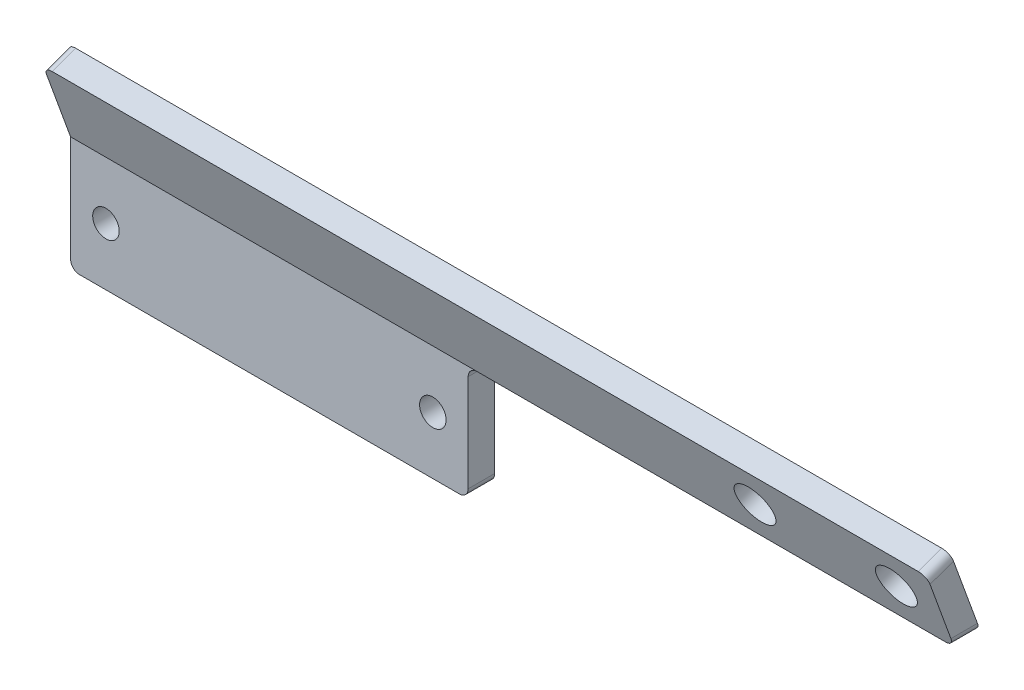
ISO-10303-21;
HEADER;
FILE_DESCRIPTION(('STEP AP214'),'2;1');
FILE_NAME('part.step','',(''),(''),'','','');
FILE_SCHEMA(('AUTOMOTIVE_DESIGN { 1 0 10303 214 1 1 1 1 }'));
ENDSEC;
DATA;
#1=APPLICATION_CONTEXT('core data for automotive mechanical design processes');
#2=APPLICATION_PROTOCOL_DEFINITION('international standard','automotive_design',2000,#1);
#3=PRODUCT_CONTEXT('',#1,'mechanical');
#4=PRODUCT('Part','Part','',(#3));
#5=PRODUCT_RELATED_PRODUCT_CATEGORY('part','',(#4));
#6=PRODUCT_DEFINITION_FORMATION('','',#4);
#7=PRODUCT_DEFINITION_CONTEXT('part definition',#1,'design');
#8=PRODUCT_DEFINITION('design','',#6,#7);
#9=PRODUCT_DEFINITION_SHAPE('','',#8);
#10=(LENGTH_UNIT() NAMED_UNIT(*) SI_UNIT(.MILLI.,.METRE.));
#11=(NAMED_UNIT(*) PLANE_ANGLE_UNIT() SI_UNIT($,.RADIAN.));
#12=(NAMED_UNIT(*) SI_UNIT($,.STERADIAN.) SOLID_ANGLE_UNIT());
#13=UNCERTAINTY_MEASURE_WITH_UNIT(LENGTH_MEASURE(1.E-05),#10,'distance_accuracy_value','');
#14=(GEOMETRIC_REPRESENTATION_CONTEXT(3) GLOBAL_UNCERTAINTY_ASSIGNED_CONTEXT((#13)) GLOBAL_UNIT_ASSIGNED_CONTEXT((#10,
#11,#12)) REPRESENTATION_CONTEXT('',''));
#15=CARTESIAN_POINT('',(0.,0.,0.));
#16=DIRECTION('',(0.,0.,1.));
#17=DIRECTION('',(1.,0.,0.));
#18=AXIS2_PLACEMENT_3D('',#15,#16,#17);
#19=CARTESIAN_POINT('',(0.,0.,3.));
#20=DIRECTION('',(0.,0.,-1.));
#21=DIRECTION('',(-1.,0.,0.));
#22=AXIS2_PLACEMENT_3D('',#19,#20,#21);
#23=PLANE('',#22);
#24=DIRECTION('',(1.,0.,0.));
#25=VECTOR('',#24,1.);
#26=CARTESIAN_POINT('',(0.,0.,3.));
#27=LINE('',#26,#25);
#28=CARTESIAN_POINT('',(1.,0.,3.));
#29=VERTEX_POINT('',#28);
#30=CARTESIAN_POINT('',(44.,0.,3.));
#31=VERTEX_POINT('',#30);
#32=EDGE_CURVE('E222',#29,#31,#27,.T.);
#33=ORIENTED_EDGE('',*,*,#32,.T.);
#34=CARTESIAN_POINT('',(44.,1.,3.));
#35=DIRECTION('',(0.,0.,-1.));
#36=DIRECTION('',(-1.,0.,0.));
#37=AXIS2_PLACEMENT_3D('',#34,#35,#36);
#38=CIRCLE('',#37,1.);
#39=CARTESIAN_POINT('',(45.,1.,3.));
#40=VERTEX_POINT('',#39);
#41=EDGE_CURVE('E156',#31,#40,#38,.F.);
#42=ORIENTED_EDGE('',*,*,#41,.T.);
#43=DIRECTION('',(0.,1.,0.));
#44=VECTOR('',#43,1.);
#45=CARTESIAN_POINT('',(45.,0.,3.));
#46=LINE('',#45,#44);
#47=CARTESIAN_POINT('',(45.,12.,3.));
#48=VERTEX_POINT('',#47);
#49=EDGE_CURVE('E224',#40,#48,#46,.T.);
#50=ORIENTED_EDGE('',*,*,#49,.T.);
#51=CARTESIAN_POINT('',(46.,12.,3.));
#52=DIRECTION('',(0.,0.,-1.));
#53=DIRECTION('',(-1.,0.,0.));
#54=AXIS2_PLACEMENT_3D('',#51,#52,#53);
#55=CIRCLE('',#54,1.);
#56=CARTESIAN_POINT('',(46.,13.,3.));
#57=VERTEX_POINT('',#56);
#58=EDGE_CURVE('E11',#48,#57,#55,.T.);
#59=ORIENTED_EDGE('',*,*,#58,.T.);
#60=DIRECTION('',(-1.,0.,0.));
#61=VECTOR('',#60,1.);
#62=CARTESIAN_POINT('',(0.,13.,3.));
#63=LINE('',#62,#61);
#64=CARTESIAN_POINT('',(0.,13.,3.));
#65=VERTEX_POINT('',#64);
#66=EDGE_CURVE('E47',#57,#65,#63,.T.);
#67=ORIENTED_EDGE('',*,*,#66,.T.);
#68=DIRECTION('',(0.,-1.,0.));
#69=VECTOR('',#68,1.);
#70=CARTESIAN_POINT('',(0.,0.,3.));
#71=LINE('',#70,#69);
#72=CARTESIAN_POINT('',(0.,1.,3.));
#73=VERTEX_POINT('',#72);
#74=EDGE_CURVE('E223',#65,#73,#71,.T.);
#75=ORIENTED_EDGE('',*,*,#74,.T.);
#76=CARTESIAN_POINT('',(1.,1.,3.));
#77=DIRECTION('',(0.,0.,-1.));
#78=DIRECTION('',(-1.,0.,0.));
#79=AXIS2_PLACEMENT_3D('',#76,#77,#78);
#80=CIRCLE('',#79,1.);
#81=EDGE_CURVE('E157',#73,#29,#80,.F.);
#82=ORIENTED_EDGE('',*,*,#81,.T.);
#83=EDGE_LOOP('',(#33,#42,#50,#59,#67,#75,#82));
#84=FACE_BOUND('',#83,.T.);
#85=CARTESIAN_POINT('',(41.,6.5,3.));
#86=DIRECTION('',(0.,0.,1.));
#87=DIRECTION('',(1.,0.,0.));
#88=AXIS2_PLACEMENT_3D('',#85,#86,#87);
#89=CIRCLE('',#88,1.5);
#90=CARTESIAN_POINT('',(42.5,6.5,3.));
#91=VERTEX_POINT('',#90);
#92=EDGE_CURVE('E262',#91,#91,#89,.T.);
#93=ORIENTED_EDGE('',*,*,#92,.F.);
#94=EDGE_LOOP('',(#93));
#95=FACE_BOUND('',#94,.T.);
#96=CARTESIAN_POINT('',(4.,6.5,3.));
#97=DIRECTION('',(0.,0.,-1.));
#98=DIRECTION('',(-1.,0.,0.));
#99=AXIS2_PLACEMENT_3D('',#96,#97,#98);
#100=CIRCLE('',#99,1.5);
#101=CARTESIAN_POINT('',(2.5,6.5,3.));
#102=VERTEX_POINT('',#101);
#103=EDGE_CURVE('E244',#102,#102,#100,.T.);
#104=ORIENTED_EDGE('',*,*,#103,.T.);
#105=EDGE_LOOP('',(#104));
#106=FACE_BOUND('',#105,.T.);
#107=ADVANCED_FACE('F32',(#84,#95,#106),#23,.F.);
#108=CARTESIAN_POINT('',(0.,0.,0.));
#109=DIRECTION('',(0.,0.,-1.));
#110=DIRECTION('',(-1.,0.,0.));
#111=AXIS2_PLACEMENT_3D('',#108,#109,#110);
#112=PLANE('',#111);
#113=DIRECTION('',(0.,1.,0.));
#114=VECTOR('',#113,1.);
#115=CARTESIAN_POINT('',(45.,0.,0.));
#116=LINE('',#115,#114);
#117=CARTESIAN_POINT('',(45.,1.,0.));
#118=VERTEX_POINT('',#117);
#119=CARTESIAN_POINT('',(45.,12.,0.));
#120=VERTEX_POINT('',#119);
#121=EDGE_CURVE('E142',#118,#120,#116,.T.);
#122=ORIENTED_EDGE('',*,*,#121,.F.);
#123=CARTESIAN_POINT('',(44.,1.,0.));
#124=DIRECTION('',(0.,0.,-1.));
#125=DIRECTION('',(-1.,0.,0.));
#126=AXIS2_PLACEMENT_3D('',#123,#124,#125);
#127=CIRCLE('',#126,1.);
#128=CARTESIAN_POINT('',(44.,0.,0.));
#129=VERTEX_POINT('',#128);
#130=EDGE_CURVE('E137',#118,#129,#127,.T.);
#131=ORIENTED_EDGE('',*,*,#130,.T.);
#132=DIRECTION('',(1.,0.,0.));
#133=VECTOR('',#132,1.);
#134=CARTESIAN_POINT('',(0.,0.,0.));
#135=LINE('',#134,#133);
#136=CARTESIAN_POINT('',(1.,0.,0.));
#137=VERTEX_POINT('',#136);
#138=EDGE_CURVE('E140',#137,#129,#135,.T.);
#139=ORIENTED_EDGE('',*,*,#138,.F.);
#140=CARTESIAN_POINT('',(1.,1.,0.));
#141=DIRECTION('',(0.,0.,-1.));
#142=DIRECTION('',(-1.,0.,0.));
#143=AXIS2_PLACEMENT_3D('',#140,#141,#142);
#144=CIRCLE('',#143,1.);
#145=CARTESIAN_POINT('',(0.,1.,0.));
#146=VERTEX_POINT('',#145);
#147=EDGE_CURVE('E147',#137,#146,#144,.T.);
#148=ORIENTED_EDGE('',*,*,#147,.T.);
#149=DIRECTION('',(0.,-1.,0.));
#150=VECTOR('',#149,1.);
#151=CARTESIAN_POINT('',(0.,0.,0.));
#152=LINE('',#151,#150);
#153=CARTESIAN_POINT('',(0.,13.,0.));
#154=VERTEX_POINT('',#153);
#155=EDGE_CURVE('E152',#154,#146,#152,.T.);
#156=ORIENTED_EDGE('',*,*,#155,.F.);
#157=DIRECTION('',(-1.,0.,0.));
#158=VECTOR('',#157,1.);
#159=CARTESIAN_POINT('',(0.,13.,0.));
#160=LINE('',#159,#158);
#161=CARTESIAN_POINT('',(46.,13.,0.));
#162=VERTEX_POINT('',#161);
#163=EDGE_CURVE('E70',#162,#154,#160,.T.);
#164=ORIENTED_EDGE('',*,*,#163,.F.);
#165=CARTESIAN_POINT('',(46.,12.,0.));
#166=DIRECTION('',(0.,0.,-1.));
#167=DIRECTION('',(-1.,0.,0.));
#168=AXIS2_PLACEMENT_3D('',#165,#166,#167);
#169=CIRCLE('',#168,1.);
#170=EDGE_CURVE('E40',#162,#120,#169,.F.);
#171=ORIENTED_EDGE('',*,*,#170,.T.);
#172=EDGE_LOOP('',(#122,#131,#139,#148,#156,#164,#171));
#173=FACE_BOUND('',#172,.T.);
#174=CARTESIAN_POINT('',(41.,6.5,0.));
#175=DIRECTION('',(0.,0.,1.));
#176=DIRECTION('',(1.,0.,0.));
#177=AXIS2_PLACEMENT_3D('',#174,#175,#176);
#178=CIRCLE('',#177,1.5);
#179=CARTESIAN_POINT('',(42.5,6.5,0.));
#180=VERTEX_POINT('',#179);
#181=EDGE_CURVE('E217',#180,#180,#178,.T.);
#182=ORIENTED_EDGE('',*,*,#181,.T.);
#183=EDGE_LOOP('',(#182));
#184=FACE_BOUND('',#183,.T.);
#185=CARTESIAN_POINT('',(4.,6.5,0.));
#186=DIRECTION('',(0.,0.,-1.));
#187=DIRECTION('',(-1.,0.,0.));
#188=AXIS2_PLACEMENT_3D('',#185,#186,#187);
#189=CIRCLE('',#188,1.5);
#190=CARTESIAN_POINT('',(2.5,6.5,0.));
#191=VERTEX_POINT('',#190);
#192=EDGE_CURVE('E259',#191,#191,#189,.T.);
#193=ORIENTED_EDGE('',*,*,#192,.F.);
#194=EDGE_LOOP('',(#193));
#195=FACE_BOUND('',#194,.T.);
#196=ADVANCED_FACE('F138',(#173,#184,#195),#112,.T.);
#197=CARTESIAN_POINT('',(0.,0.,3.));
#198=DIRECTION('',(1.,0.,0.));
#199=DIRECTION('',(0.,0.,-1.));
#200=AXIS2_PLACEMENT_3D('',#197,#198,#199);
#201=PLANE('',#200);
#202=DIRECTION('',(0.,0.939692620785908,0.342020143325669));
#203=VECTOR('',#202,1.);
#204=CARTESIAN_POINT('',(0.,21.4327447933293,6.06926809793516));
#205=LINE('',#204,#203);
#206=CARTESIAN_POINT('',(0.,20.4930521725434,5.72724795460949));
#207=VERTEX_POINT('',#206);
#208=EDGE_CURVE('E361',#65,#207,#205,.T.);
#209=ORIENTED_EDGE('',*,*,#208,.T.);
#210=DIRECTION('',(0.,0.34202014332567,-0.939692620785908));
#211=VECTOR('',#210,1.);
#212=CARTESIAN_POINT('',(0.,21.4572335870732,3.07818128993102));
#213=LINE('',#212,#211);
#214=CARTESIAN_POINT('',(0.,21.4572335870732,3.07818128993103));
#215=VERTEX_POINT('',#214);
#216=EDGE_CURVE('E202',#207,#215,#213,.T.);
#217=ORIENTED_EDGE('',*,*,#216,.T.);
#218=DIRECTION('',(0.,-0.939692620785908,-0.342020143325669));
#219=VECTOR('',#218,1.);
#220=CARTESIAN_POINT('',(0.,13.,0.));
#221=LINE('',#220,#219);
#222=EDGE_CURVE('E216',#215,#154,#221,.T.);
#223=ORIENTED_EDGE('',*,*,#222,.T.);
#224=ORIENTED_EDGE('',*,*,#155,.T.);
#225=DIRECTION('',(0.,0.,-1.));
#226=VECTOR('',#225,1.);
#227=CARTESIAN_POINT('',(0.,1.,3.));
#228=LINE('',#227,#226);
#229=EDGE_CURVE('E200',#146,#73,#228,.F.);
#230=ORIENTED_EDGE('',*,*,#229,.T.);
#231=ORIENTED_EDGE('',*,*,#74,.F.);
#232=EDGE_LOOP('',(#209,#217,#223,#224,#230,#231));
#233=FACE_BOUND('',#232,.T.);
#234=ADVANCED_FACE('F212',(#233),#201,.F.);
#235=CARTESIAN_POINT('',(0.,0.,3.));
#236=DIRECTION('',(0.,1.,0.));
#237=DIRECTION('',(0.,0.,1.));
#238=AXIS2_PLACEMENT_3D('',#235,#236,#237);
#239=PLANE('',#238);
#240=ORIENTED_EDGE('',*,*,#138,.T.);
#241=DIRECTION('',(0.,0.,-1.));
#242=VECTOR('',#241,1.);
#243=CARTESIAN_POINT('',(44.,0.,3.));
#244=LINE('',#243,#242);
#245=EDGE_CURVE('E56',#129,#31,#244,.F.);
#246=ORIENTED_EDGE('',*,*,#245,.T.);
#247=ORIENTED_EDGE('',*,*,#32,.F.);
#248=DIRECTION('',(0.,0.,-1.));
#249=VECTOR('',#248,1.);
#250=CARTESIAN_POINT('',(1.,0.,3.));
#251=LINE('',#250,#249);
#252=EDGE_CURVE('E146',#29,#137,#251,.T.);
#253=ORIENTED_EDGE('',*,*,#252,.T.);
#254=EDGE_LOOP('',(#240,#246,#247,#253));
#255=FACE_BOUND('',#254,.T.);
#256=ADVANCED_FACE('F150',(#255),#239,.F.);
#257=CARTESIAN_POINT('',(45.,0.,3.));
#258=DIRECTION('',(-1.,0.,0.));
#259=DIRECTION('',(0.,0.,1.));
#260=AXIS2_PLACEMENT_3D('',#257,#258,#259);
#261=PLANE('',#260);
#262=ORIENTED_EDGE('',*,*,#121,.T.);
#263=DIRECTION('',(0.,0.,-1.));
#264=VECTOR('',#263,1.);
#265=CARTESIAN_POINT('',(45.,12.,3.));
#266=LINE('',#265,#264);
#267=EDGE_CURVE('E169',#120,#48,#266,.F.);
#268=ORIENTED_EDGE('',*,*,#267,.T.);
#269=ORIENTED_EDGE('',*,*,#49,.F.);
#270=DIRECTION('',(0.,0.,-1.));
#271=VECTOR('',#270,1.);
#272=CARTESIAN_POINT('',(45.,1.,3.));
#273=LINE('',#272,#271);
#274=EDGE_CURVE('E171',#40,#118,#273,.T.);
#275=ORIENTED_EDGE('',*,*,#274,.T.);
#276=EDGE_LOOP('',(#262,#268,#269,#275));
#277=FACE_BOUND('',#276,.T.);
#278=ADVANCED_FACE('F167',(#277),#261,.F.);
#279=CARTESIAN_POINT('',(41.,6.5,0.));
#280=DIRECTION('',(0.,0.,1.));
#281=DIRECTION('',(1.,0.,0.));
#282=AXIS2_PLACEMENT_3D('',#279,#280,#281);
#283=CYLINDRICAL_SURFACE('',#282,1.5);
#284=ORIENTED_EDGE('',*,*,#181,.F.);
#285=EDGE_LOOP('',(#284));
#286=FACE_BOUND('',#285,.T.);
#287=ORIENTED_EDGE('',*,*,#92,.T.);
#288=EDGE_LOOP('',(#287));
#289=FACE_BOUND('',#288,.T.);
#290=ADVANCED_FACE('F269',(#286,#289),#283,.F.);
#291=CARTESIAN_POINT('',(4.,6.5,0.));
#292=DIRECTION('',(0.,0.,1.));
#293=DIRECTION('',(1.,0.,0.));
#294=AXIS2_PLACEMENT_3D('',#291,#292,#293);
#295=CYLINDRICAL_SURFACE('',#294,1.5);
#296=ORIENTED_EDGE('',*,*,#192,.T.);
#297=EDGE_LOOP('',(#296));
#298=FACE_BOUND('',#297,.T.);
#299=ORIENTED_EDGE('',*,*,#103,.F.);
#300=EDGE_LOOP('',(#299));
#301=FACE_BOUND('',#300,.T.);
#302=ADVANCED_FACE('F275',(#298,#301),#295,.F.);
#303=CARTESIAN_POINT('',(100.,13.,3.));
#304=DIRECTION('',(0.,-1.,0.));
#305=DIRECTION('',(0.,0.,-1.));
#306=AXIS2_PLACEMENT_3D('',#303,#304,#305);
#307=PLANE('',#306);
#308=DIRECTION('',(-1.,0.,0.));
#309=VECTOR('',#308,1.);
#310=CARTESIAN_POINT('',(100.,13.,3.));
#311=LINE('',#310,#309);
#312=CARTESIAN_POINT('',(99.,13.,3.));
#313=VERTEX_POINT('',#312);
#314=EDGE_CURVE('E246',#313,#57,#311,.T.);
#315=ORIENTED_EDGE('',*,*,#314,.T.);
#316=DIRECTION('',(0.,0.,-1.));
#317=VECTOR('',#316,1.);
#318=CARTESIAN_POINT('',(46.,13.,3.));
#319=LINE('',#318,#317);
#320=EDGE_CURVE('E179',#57,#162,#319,.T.);
#321=ORIENTED_EDGE('',*,*,#320,.T.);
#322=DIRECTION('',(-1.,0.,0.));
#323=VECTOR('',#322,1.);
#324=CARTESIAN_POINT('',(100.,13.,0.));
#325=LINE('',#324,#323);
#326=CARTESIAN_POINT('',(99.,13.,0.));
#327=VERTEX_POINT('',#326);
#328=EDGE_CURVE('E241',#327,#162,#325,.T.);
#329=ORIENTED_EDGE('',*,*,#328,.F.);
#330=DIRECTION('',(0.,0.,1.));
#331=VECTOR('',#330,1.);
#332=CARTESIAN_POINT('',(99.,13.,3.));
#333=LINE('',#332,#331);
#334=EDGE_CURVE('E238',#327,#313,#333,.T.);
#335=ORIENTED_EDGE('',*,*,#334,.T.);
#336=EDGE_LOOP('',(#315,#321,#329,#335));
#337=FACE_BOUND('',#336,.T.);
#338=ADVANCED_FACE('F277',(#337),#307,.T.);
#339=CARTESIAN_POINT('',(100.,13.,0.));
#340=DIRECTION('',(0.,0.342020143325669,-0.939692620785908));
#341=DIRECTION('',(0.,0.939692620785908,0.342020143325669));
#342=AXIS2_PLACEMENT_3D('',#339,#340,#341);
#343=PLANE('',#342);
#344=CARTESIAN_POINT('',(79.,18.1927982080664,1.89002398028705));
#345=DIRECTION('',(0.,0.342020143325669,-0.939692620785908));
#346=DIRECTION('',(0.,0.939692620785908,0.342020143325669));
#347=AXIS2_PLACEMENT_3D('',#344,#345,#346);
#348=CIRCLE('',#347,2.25);
#349=CARTESIAN_POINT('',(79.,20.3071066048347,2.6595693027698));
#350=VERTEX_POINT('',#349);
#351=EDGE_CURVE('E365',#350,#350,#348,.T.);
#352=ORIENTED_EDGE('',*,*,#351,.F.);
#353=EDGE_LOOP('',(#352));
#354=FACE_BOUND('',#353,.T.);
#355=CARTESIAN_POINT('',(95.,18.1927982080664,1.89002398028705));
#356=DIRECTION('',(0.,0.342020143325669,-0.939692620785908));
#357=DIRECTION('',(0.,0.939692620785908,0.342020143325669));
#358=AXIS2_PLACEMENT_3D('',#355,#356,#357);
#359=CIRCLE('',#358,2.25);
#360=CARTESIAN_POINT('',(95.,20.3071066048347,2.6595693027698));
#361=VERTEX_POINT('',#360);
#362=EDGE_CURVE('E362',#361,#361,#359,.T.);
#363=ORIENTED_EDGE('',*,*,#362,.F.);
#364=EDGE_LOOP('',(#363));
#365=FACE_BOUND('',#364,.T.);
#366=DIRECTION('',(0.,-0.939692620785908,-0.342020143325669));
#367=VECTOR('',#366,1.);
#368=CARTESIAN_POINT('',(100.,13.,0.));
#369=LINE('',#368,#367);
#370=CARTESIAN_POINT('',(100.,21.4572335870732,3.07818128993103));
#371=VERTEX_POINT('',#370);
#372=CARTESIAN_POINT('',(100.,14.,0.363970234266203));
#373=VERTEX_POINT('',#372);
#374=EDGE_CURVE('E355',#371,#373,#369,.T.);
#375=ORIENTED_EDGE('',*,*,#374,.T.);
#376=CARTESIAN_POINT('',(99.,14.,0.363970234266203));
#377=DIRECTION('',(0.,0.342020143325669,-0.939692620785908));
#378=DIRECTION('',(0.,0.939692620785908,0.342020143325669));
#379=AXIS2_PLACEMENT_3D('',#376,#377,#378);
#380=ELLIPSE('',#379,1.06417777247591,1.);
#381=EDGE_CURVE('E82',#373,#327,#380,.T.);
#382=ORIENTED_EDGE('',*,*,#381,.T.);
#383=ORIENTED_EDGE('',*,*,#328,.T.);
#384=ORIENTED_EDGE('',*,*,#163,.T.);
#385=ORIENTED_EDGE('',*,*,#222,.F.);
#386=CARTESIAN_POINT('',(1.,21.4572335870732,3.07818128993103));
#387=DIRECTION('',(0.,0.342020143325669,-0.939692620785908));
#388=DIRECTION('',(0.,0.939692620785908,0.342020143325669));
#389=AXIS2_PLACEMENT_3D('',#386,#387,#388);
#390=CIRCLE('',#389,1.);
#391=CARTESIAN_POINT('',(1.,22.3969262078591,3.42020143325669));
#392=VERTEX_POINT('',#391);
#393=EDGE_CURVE('E190',#215,#392,#390,.T.);
#394=ORIENTED_EDGE('',*,*,#393,.T.);
#395=DIRECTION('',(-1.,0.,0.));
#396=VECTOR('',#395,1.);
#397=CARTESIAN_POINT('',(100.,22.3969262078591,3.42020143325669));
#398=LINE('',#397,#396);
#399=CARTESIAN_POINT('',(99.,22.3969262078591,3.42020143325669));
#400=VERTEX_POINT('',#399);
#401=EDGE_CURVE('E245',#400,#392,#398,.T.);
#402=ORIENTED_EDGE('',*,*,#401,.F.);
#403=CARTESIAN_POINT('',(99.,21.4572335870732,3.07818128993103));
#404=DIRECTION('',(0.,0.342020143325669,-0.939692620785908));
#405=DIRECTION('',(0.,0.939692620785908,0.342020143325669));
#406=AXIS2_PLACEMENT_3D('',#403,#404,#405);
#407=CIRCLE('',#406,1.);
#408=EDGE_CURVE('E192',#400,#371,#407,.T.);
#409=ORIENTED_EDGE('',*,*,#408,.T.);
#410=EDGE_LOOP('',(#375,#382,#383,#384,#385,#394,#402,#409));
#411=FACE_BOUND('',#410,.T.);
#412=ADVANCED_FACE('F284',(#354,#365,#411),#343,.T.);
#413=CARTESIAN_POINT('',(100.,22.3969262078591,3.42020143325669));
#414=DIRECTION('',(0.,0.939692620785908,0.34202014332567));
#415=DIRECTION('',(0.,-0.34202014332567,0.939692620785908));
#416=AXIS2_PLACEMENT_3D('',#413,#414,#415);
#417=PLANE('',#416);
#418=DIRECTION('',(-1.,0.,0.));
#419=VECTOR('',#418,1.);
#420=CARTESIAN_POINT('',(100.,21.4327447933293,6.06926809793516));
#421=LINE('',#420,#419);
#422=CARTESIAN_POINT('',(99.,21.4327447933293,6.06926809793516));
#423=VERTEX_POINT('',#422);
#424=CARTESIAN_POINT('',(1.,21.4327447933293,6.06926809793516));
#425=VERTEX_POINT('',#424);
#426=EDGE_CURVE('E255',#423,#425,#421,.T.);
#427=ORIENTED_EDGE('',*,*,#426,.F.);
#428=DIRECTION('',(0.,0.34202014332567,-0.939692620785908));
#429=VECTOR('',#428,1.);
#430=CARTESIAN_POINT('',(99.,22.3969262078591,3.42020143325669));
#431=LINE('',#430,#429);
#432=EDGE_CURVE('E197',#423,#400,#431,.T.);
#433=ORIENTED_EDGE('',*,*,#432,.T.);
#434=ORIENTED_EDGE('',*,*,#401,.T.);
#435=DIRECTION('',(0.,0.34202014332567,-0.939692620785908));
#436=VECTOR('',#435,1.);
#437=CARTESIAN_POINT('',(1.,21.4327447933293,6.06926809793516));
#438=LINE('',#437,#436);
#439=EDGE_CURVE('E195',#392,#425,#438,.F.);
#440=ORIENTED_EDGE('',*,*,#439,.T.);
#441=EDGE_LOOP('',(#427,#433,#434,#440));
#442=FACE_BOUND('',#441,.T.);
#443=ADVANCED_FACE('F338',(#442),#417,.T.);
#444=CARTESIAN_POINT('',(100.,21.4327447933293,6.06926809793516));
#445=DIRECTION('',(0.,-0.342020143325669,0.939692620785908));
#446=DIRECTION('',(0.,-0.939692620785908,-0.342020143325669));
#447=AXIS2_PLACEMENT_3D('',#444,#445,#446);
#448=PLANE('',#447);
#449=CARTESIAN_POINT('',(79.,17.2286167935366,4.53909064496551));
#450=DIRECTION('',(0.,-0.342020143325669,0.939692620785908));
#451=DIRECTION('',(0.,-0.939692620785908,-0.342020143325669));
#452=AXIS2_PLACEMENT_3D('',#449,#450,#451);
#453=CIRCLE('',#452,2.25);
#454=CARTESIAN_POINT('',(79.,15.1143083967683,3.76954532248276));
#455=VERTEX_POINT('',#454);
#456=EDGE_CURVE('E349',#455,#455,#453,.T.);
#457=ORIENTED_EDGE('',*,*,#456,.F.);
#458=EDGE_LOOP('',(#457));
#459=FACE_BOUND('',#458,.T.);
#460=CARTESIAN_POINT('',(95.,17.2286167935366,4.53909064496551));
#461=DIRECTION('',(0.,-0.342020143325669,0.939692620785908));
#462=DIRECTION('',(0.,-0.939692620785908,-0.342020143325669));
#463=AXIS2_PLACEMENT_3D('',#460,#461,#462);
#464=CIRCLE('',#463,2.25);
#465=CARTESIAN_POINT('',(95.,15.1143083967683,3.76954532248276));
#466=VERTEX_POINT('',#465);
#467=EDGE_CURVE('E352',#466,#466,#464,.T.);
#468=ORIENTED_EDGE('',*,*,#467,.F.);
#469=EDGE_LOOP('',(#468));
#470=FACE_BOUND('',#469,.T.);
#471=ORIENTED_EDGE('',*,*,#314,.F.);
#472=CARTESIAN_POINT('',(99.,14.,3.3639702342662));
#473=DIRECTION('',(0.,-0.342020143325669,0.939692620785908));
#474=DIRECTION('',(0.,0.939692620785908,0.342020143325669));
#475=AXIS2_PLACEMENT_3D('',#472,#473,#474);
#476=ELLIPSE('',#475,1.06417777247591,1.);
#477=CARTESIAN_POINT('',(100.,14.,3.3639702342662));
#478=VERTEX_POINT('',#477);
#479=EDGE_CURVE('E184',#313,#478,#476,.T.);
#480=ORIENTED_EDGE('',*,*,#479,.T.);
#481=DIRECTION('',(0.,0.939692620785908,0.342020143325669));
#482=VECTOR('',#481,1.);
#483=CARTESIAN_POINT('',(100.,21.4327447933293,6.06926809793516));
#484=LINE('',#483,#482);
#485=CARTESIAN_POINT('',(100.,20.4930521725434,5.72724795460949));
#486=VERTEX_POINT('',#485);
#487=EDGE_CURVE('E356',#478,#486,#484,.T.);
#488=ORIENTED_EDGE('',*,*,#487,.T.);
#489=CARTESIAN_POINT('',(99.,20.4930521725434,5.72724795460949));
#490=DIRECTION('',(0.,-0.342020143325669,0.939692620785908));
#491=DIRECTION('',(0.,-0.939692620785908,-0.342020143325669));
#492=AXIS2_PLACEMENT_3D('',#489,#490,#491);
#493=CIRCLE('',#492,1.);
#494=EDGE_CURVE('E177',#486,#423,#493,.T.);
#495=ORIENTED_EDGE('',*,*,#494,.T.);
#496=ORIENTED_EDGE('',*,*,#426,.T.);
#497=CARTESIAN_POINT('',(1.,20.4930521725434,5.72724795460949));
#498=DIRECTION('',(0.,-0.342020143325669,0.939692620785908));
#499=DIRECTION('',(0.,-0.939692620785908,-0.342020143325669));
#500=AXIS2_PLACEMENT_3D('',#497,#498,#499);
#501=CIRCLE('',#500,1.);
#502=EDGE_CURVE('E175',#425,#207,#501,.T.);
#503=ORIENTED_EDGE('',*,*,#502,.T.);
#504=ORIENTED_EDGE('',*,*,#208,.F.);
#505=ORIENTED_EDGE('',*,*,#66,.F.);
#506=EDGE_LOOP('',(#471,#480,#488,#495,#496,#503,#504,#505));
#507=FACE_BOUND('',#506,.T.);
#508=ADVANCED_FACE('F334',(#459,#470,#507),#448,.T.);
#509=CARTESIAN_POINT('',(100.,0.,0.));
#510=DIRECTION('',(1.,0.,0.));
#511=DIRECTION('',(0.,0.,-1.));
#512=AXIS2_PLACEMENT_3D('',#509,#510,#511);
#513=PLANE('',#512);
#514=ORIENTED_EDGE('',*,*,#487,.F.);
#515=DIRECTION('',(0.,0.,1.));
#516=VECTOR('',#515,1.);
#517=CARTESIAN_POINT('',(100.,14.,0.));
#518=LINE('',#517,#516);
#519=EDGE_CURVE('E188',#478,#373,#518,.F.);
#520=ORIENTED_EDGE('',*,*,#519,.T.);
#521=ORIENTED_EDGE('',*,*,#374,.F.);
#522=DIRECTION('',(0.,0.34202014332567,-0.939692620785908));
#523=VECTOR('',#522,1.);
#524=CARTESIAN_POINT('',(100.,19.9365224673465,7.25630075289354));
#525=LINE('',#524,#523);
#526=EDGE_CURVE('E186',#371,#486,#525,.F.);
#527=ORIENTED_EDGE('',*,*,#526,.T.);
#528=EDGE_LOOP('',(#514,#520,#521,#527));
#529=FACE_BOUND('',#528,.T.);
#530=ADVANCED_FACE('F302',(#529),#513,.T.);
#531=CARTESIAN_POINT('',(46.,12.,3.));
#532=DIRECTION('',(0.,0.,-1.));
#533=DIRECTION('',(-1.,0.,0.));
#534=AXIS2_PLACEMENT_3D('',#531,#532,#533);
#535=CYLINDRICAL_SURFACE('',#534,1.);
#536=ORIENTED_EDGE('',*,*,#58,.F.);
#537=ORIENTED_EDGE('',*,*,#267,.F.);
#538=ORIENTED_EDGE('',*,*,#170,.F.);
#539=ORIENTED_EDGE('',*,*,#320,.F.);
#540=EDGE_LOOP('',(#536,#537,#538,#539));
#541=FACE_BOUND('',#540,.T.);
#542=ADVANCED_FACE('F174',(#541),#535,.F.);
#543=CARTESIAN_POINT('',(99.,14.,3.));
#544=DIRECTION('',(0.,0.,1.));
#545=DIRECTION('',(1.,0.,0.));
#546=AXIS2_PLACEMENT_3D('',#543,#544,#545);
#547=CYLINDRICAL_SURFACE('',#546,1.);
#548=ORIENTED_EDGE('',*,*,#381,.F.);
#549=ORIENTED_EDGE('',*,*,#519,.F.);
#550=ORIENTED_EDGE('',*,*,#479,.F.);
#551=ORIENTED_EDGE('',*,*,#334,.F.);
#552=EDGE_LOOP('',(#548,#549,#550,#551));
#553=FACE_BOUND('',#552,.T.);
#554=ADVANCED_FACE('F301',(#553),#547,.T.);
#555=CARTESIAN_POINT('',(99.,21.4572335870732,3.07818128993102));
#556=DIRECTION('',(0.,0.34202014332567,-0.939692620785908));
#557=DIRECTION('',(0.,0.939692620785908,0.34202014332567));
#558=AXIS2_PLACEMENT_3D('',#555,#556,#557);
#559=CYLINDRICAL_SURFACE('',#558,1.);
#560=ORIENTED_EDGE('',*,*,#494,.F.);
#561=ORIENTED_EDGE('',*,*,#526,.F.);
#562=ORIENTED_EDGE('',*,*,#408,.F.);
#563=ORIENTED_EDGE('',*,*,#432,.F.);
#564=EDGE_LOOP('',(#560,#561,#562,#563));
#565=FACE_BOUND('',#564,.T.);
#566=ADVANCED_FACE('F305',(#565),#559,.T.);
#567=CARTESIAN_POINT('',(1.,18.9723410528167,9.90536741757201));
#568=DIRECTION('',(0.,-0.34202014332567,0.939692620785908));
#569=DIRECTION('',(0.,-0.939692620785908,-0.34202014332567));
#570=AXIS2_PLACEMENT_3D('',#567,#568,#569);
#571=CYLINDRICAL_SURFACE('',#570,1.);
#572=ORIENTED_EDGE('',*,*,#502,.F.);
#573=ORIENTED_EDGE('',*,*,#439,.F.);
#574=ORIENTED_EDGE('',*,*,#393,.F.);
#575=ORIENTED_EDGE('',*,*,#216,.F.);
#576=EDGE_LOOP('',(#572,#573,#574,#575));
#577=FACE_BOUND('',#576,.T.);
#578=ADVANCED_FACE('F309',(#577),#571,.T.);
#579=CARTESIAN_POINT('',(44.,1.,3.));
#580=DIRECTION('',(0.,0.,-1.));
#581=DIRECTION('',(-1.,0.,0.));
#582=AXIS2_PLACEMENT_3D('',#579,#580,#581);
#583=CYLINDRICAL_SURFACE('',#582,1.);
#584=ORIENTED_EDGE('',*,*,#41,.F.);
#585=ORIENTED_EDGE('',*,*,#245,.F.);
#586=ORIENTED_EDGE('',*,*,#130,.F.);
#587=ORIENTED_EDGE('',*,*,#274,.F.);
#588=EDGE_LOOP('',(#584,#585,#586,#587));
#589=FACE_BOUND('',#588,.T.);
#590=ADVANCED_FACE('F155',(#589),#583,.T.);
#591=CARTESIAN_POINT('',(1.,1.,3.));
#592=DIRECTION('',(0.,0.,-1.));
#593=DIRECTION('',(-1.,0.,0.));
#594=AXIS2_PLACEMENT_3D('',#591,#592,#593);
#595=CYLINDRICAL_SURFACE('',#594,1.);
#596=ORIENTED_EDGE('',*,*,#81,.F.);
#597=ORIENTED_EDGE('',*,*,#229,.F.);
#598=ORIENTED_EDGE('',*,*,#147,.F.);
#599=ORIENTED_EDGE('',*,*,#252,.F.);
#600=EDGE_LOOP('',(#596,#597,#598,#599));
#601=FACE_BOUND('',#600,.T.);
#602=ADVANCED_FACE('F34',(#601),#595,.T.);
#603=CARTESIAN_POINT('',(95.,19.2920297600312,-1.13008988748823));
#604=DIRECTION('',(0.,-0.342020143325669,0.939692620785908));
#605=DIRECTION('',(0.,-0.939692620785908,-0.342020143325669));
#606=AXIS2_PLACEMENT_3D('',#603,#604,#605);
#607=CYLINDRICAL_SURFACE('',#606,2.25);
#608=ORIENTED_EDGE('',*,*,#362,.T.);
#609=EDGE_LOOP('',(#608));
#610=FACE_BOUND('',#609,.T.);
#611=ORIENTED_EDGE('',*,*,#467,.T.);
#612=EDGE_LOOP('',(#611));
#613=FACE_BOUND('',#612,.T.);
#614=ADVANCED_FACE('F317',(#610,#613),#607,.F.);
#615=CARTESIAN_POINT('',(79.,19.2920297600312,-1.13008988748823));
#616=DIRECTION('',(0.,-0.342020143325669,0.939692620785908));
#617=DIRECTION('',(0.,-0.939692620785908,-0.342020143325669));
#618=AXIS2_PLACEMENT_3D('',#615,#616,#617);
#619=CYLINDRICAL_SURFACE('',#618,2.25);
#620=ORIENTED_EDGE('',*,*,#351,.T.);
#621=EDGE_LOOP('',(#620));
#622=FACE_BOUND('',#621,.T.);
#623=ORIENTED_EDGE('',*,*,#456,.T.);
#624=EDGE_LOOP('',(#623));
#625=FACE_BOUND('',#624,.T.);
#626=ADVANCED_FACE('F321',(#622,#625),#619,.F.);
#627=CLOSED_SHELL('',(#107,#196,#234,#256,#278,#290,#302,#338,#412,#443,#508,#530,#542,#554,
#566,#578,#590,#602,#614,#626));
#628=MANIFOLD_SOLID_BREP('B2',#627);
#629=ADVANCED_BREP_SHAPE_REPRESENTATION('',(#18,#628),#14);
#630=SHAPE_DEFINITION_REPRESENTATION(#9,#629);
ENDSEC;
END-ISO-10303-21;
